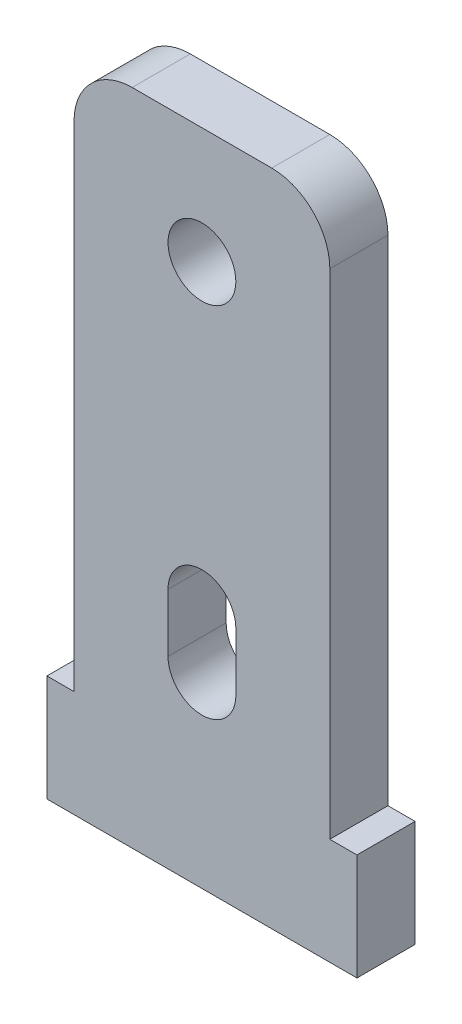
ISO-10303-21;
HEADER;
FILE_DESCRIPTION(('STEP AP214'),'2;1');
FILE_NAME('part.step','',(''),(''),'','','');
FILE_SCHEMA(('AUTOMOTIVE_DESIGN { 1 0 10303 214 1 1 1 1 }'));
ENDSEC;
DATA;
#1=APPLICATION_CONTEXT('core data for automotive mechanical design processes');
#2=APPLICATION_PROTOCOL_DEFINITION('international standard','automotive_design',2000,#1);
#3=PRODUCT_CONTEXT('',#1,'mechanical');
#4=PRODUCT('Part','Part','',(#3));
#5=PRODUCT_RELATED_PRODUCT_CATEGORY('part','',(#4));
#6=PRODUCT_DEFINITION_FORMATION('','',#4);
#7=PRODUCT_DEFINITION_CONTEXT('part definition',#1,'design');
#8=PRODUCT_DEFINITION('design','',#6,#7);
#9=PRODUCT_DEFINITION_SHAPE('','',#8);
#10=(LENGTH_UNIT() NAMED_UNIT(*) SI_UNIT(.MILLI.,.METRE.));
#11=(NAMED_UNIT(*) PLANE_ANGLE_UNIT() SI_UNIT($,.RADIAN.));
#12=(NAMED_UNIT(*) SI_UNIT($,.STERADIAN.) SOLID_ANGLE_UNIT());
#13=UNCERTAINTY_MEASURE_WITH_UNIT(LENGTH_MEASURE(1.E-05),#10,'distance_accuracy_value','');
#14=(GEOMETRIC_REPRESENTATION_CONTEXT(3) GLOBAL_UNCERTAINTY_ASSIGNED_CONTEXT((#13)) GLOBAL_UNIT_ASSIGNED_CONTEXT((#10,
#11,#12)) REPRESENTATION_CONTEXT('',''));
#15=CARTESIAN_POINT('',(0.,0.,0.));
#16=DIRECTION('',(0.,0.,1.));
#17=DIRECTION('',(1.,0.,0.));
#18=AXIS2_PLACEMENT_3D('',#15,#16,#17);
#19=CARTESIAN_POINT('',(0.,18.5,3.));
#20=DIRECTION('',(0.,1.,0.));
#21=DIRECTION('',(0.,0.,1.));
#22=AXIS2_PLACEMENT_3D('',#19,#20,#21);
#23=PLANE('',#22);
#24=DIRECTION('',(1.,0.,0.));
#25=VECTOR('',#24,1.);
#26=CARTESIAN_POINT('',(0.,18.5,0.));
#27=LINE('',#26,#25);
#28=CARTESIAN_POINT('',(-3.6,18.5,0.));
#29=VERTEX_POINT('',#28);
#30=CARTESIAN_POINT('',(3.6,18.5,0.));
#31=VERTEX_POINT('',#30);
#32=EDGE_CURVE('E185',#29,#31,#27,.T.);
#33=ORIENTED_EDGE('',*,*,#32,.F.);
#34=DIRECTION('',(0.,0.,-1.));
#35=VECTOR('',#34,1.);
#36=CARTESIAN_POINT('',(-3.6,18.5,3.));
#37=LINE('',#36,#35);
#38=CARTESIAN_POINT('',(-3.6,18.5,3.));
#39=VERTEX_POINT('',#38);
#40=EDGE_CURVE('E11',#39,#29,#37,.T.);
#41=ORIENTED_EDGE('',*,*,#40,.F.);
#42=DIRECTION('',(1.,0.,0.));
#43=VECTOR('',#42,1.);
#44=CARTESIAN_POINT('',(0.,18.5,3.));
#45=LINE('',#44,#43);
#46=CARTESIAN_POINT('',(3.6,18.5,3.));
#47=VERTEX_POINT('',#46);
#48=EDGE_CURVE('E252',#39,#47,#45,.T.);
#49=ORIENTED_EDGE('',*,*,#48,.T.);
#50=DIRECTION('',(0.,0.,-1.));
#51=VECTOR('',#50,1.);
#52=CARTESIAN_POINT('',(3.6,18.5,3.));
#53=LINE('',#52,#51);
#54=EDGE_CURVE('E53',#47,#31,#53,.T.);
#55=ORIENTED_EDGE('',*,*,#54,.T.);
#56=EDGE_LOOP('',(#33,#41,#49,#55));
#57=FACE_BOUND('',#56,.T.);
#58=ADVANCED_FACE('F34',(#57),#23,.T.);
#59=CARTESIAN_POINT('',(-3.6,15.5,3.));
#60=DIRECTION('',(0.,0.,-1.));
#61=DIRECTION('',(-1.,0.,0.));
#62=AXIS2_PLACEMENT_3D('',#59,#60,#61);
#63=CYLINDRICAL_SURFACE('',#62,3.);
#64=CARTESIAN_POINT('',(-3.6,15.5,0.));
#65=DIRECTION('',(0.,0.,1.));
#66=DIRECTION('',(1.,0.,0.));
#67=AXIS2_PLACEMENT_3D('',#64,#65,#66);
#68=CIRCLE('',#67,3.);
#69=CARTESIAN_POINT('',(-6.6,15.5,0.));
#70=VERTEX_POINT('',#69);
#71=EDGE_CURVE('E187',#29,#70,#68,.T.);
#72=ORIENTED_EDGE('',*,*,#71,.T.);
#73=DIRECTION('',(0.,0.,-1.));
#74=VECTOR('',#73,1.);
#75=CARTESIAN_POINT('',(-6.6,15.5,3.));
#76=LINE('',#75,#74);
#77=CARTESIAN_POINT('',(-6.6,15.5,3.));
#78=VERTEX_POINT('',#77);
#79=EDGE_CURVE('E44',#78,#70,#76,.T.);
#80=ORIENTED_EDGE('',*,*,#79,.F.);
#81=CARTESIAN_POINT('',(-3.6,15.5,3.));
#82=DIRECTION('',(0.,0.,1.));
#83=DIRECTION('',(1.,0.,0.));
#84=AXIS2_PLACEMENT_3D('',#81,#82,#83);
#85=CIRCLE('',#84,3.);
#86=EDGE_CURVE('E260',#39,#78,#85,.T.);
#87=ORIENTED_EDGE('',*,*,#86,.F.);
#88=ORIENTED_EDGE('',*,*,#40,.T.);
#89=EDGE_LOOP('',(#72,#80,#87,#88));
#90=FACE_BOUND('',#89,.T.);
#91=ADVANCED_FACE('F290',(#90),#63,.T.);
#92=CARTESIAN_POINT('',(-6.6,0.,3.));
#93=DIRECTION('',(1.,0.,0.));
#94=DIRECTION('',(0.,1.,0.));
#95=AXIS2_PLACEMENT_3D('',#92,#93,#94);
#96=PLANE('',#95);
#97=DIRECTION('',(0.,-1.,0.));
#98=VECTOR('',#97,1.);
#99=CARTESIAN_POINT('',(-6.6,0.,0.));
#100=LINE('',#99,#98);
#101=CARTESIAN_POINT('',(-6.59999999999999,-10.,0.));
#102=VERTEX_POINT('',#101);
#103=EDGE_CURVE('E190',#70,#102,#100,.T.);
#104=ORIENTED_EDGE('',*,*,#103,.T.);
#105=DIRECTION('',(0.,0.,-1.));
#106=VECTOR('',#105,1.);
#107=CARTESIAN_POINT('',(-6.59999999999999,-10.,3.));
#108=LINE('',#107,#106);
#109=CARTESIAN_POINT('',(-6.59999999999999,-10.,3.));
#110=VERTEX_POINT('',#109);
#111=EDGE_CURVE('E222',#110,#102,#108,.T.);
#112=ORIENTED_EDGE('',*,*,#111,.F.);
#113=DIRECTION('',(0.,-1.,0.));
#114=VECTOR('',#113,1.);
#115=CARTESIAN_POINT('',(-6.6,0.,3.));
#116=LINE('',#115,#114);
#117=EDGE_CURVE('E263',#78,#110,#116,.T.);
#118=ORIENTED_EDGE('',*,*,#117,.F.);
#119=ORIENTED_EDGE('',*,*,#79,.T.);
#120=EDGE_LOOP('',(#104,#112,#118,#119));
#121=FACE_BOUND('',#120,.T.);
#122=ADVANCED_FACE('F295',(#121),#96,.F.);
#123=CARTESIAN_POINT('',(0.,-10.,3.));
#124=DIRECTION('',(0.,1.,0.));
#125=DIRECTION('',(-1.,0.,0.));
#126=AXIS2_PLACEMENT_3D('',#123,#124,#125);
#127=PLANE('',#126);
#128=DIRECTION('',(1.,0.,0.));
#129=VECTOR('',#128,1.);
#130=CARTESIAN_POINT('',(0.,-10.,0.));
#131=LINE('',#130,#129);
#132=CARTESIAN_POINT('',(-8.,-10.,0.));
#133=VERTEX_POINT('',#132);
#134=EDGE_CURVE('E193',#133,#102,#131,.T.);
#135=ORIENTED_EDGE('',*,*,#134,.F.);
#136=DIRECTION('',(0.,0.,-1.));
#137=VECTOR('',#136,1.);
#138=CARTESIAN_POINT('',(-8.,-10.,3.));
#139=LINE('',#138,#137);
#140=CARTESIAN_POINT('',(-8.,-10.,3.));
#141=VERTEX_POINT('',#140);
#142=EDGE_CURVE('E220',#141,#133,#139,.T.);
#143=ORIENTED_EDGE('',*,*,#142,.F.);
#144=DIRECTION('',(1.,0.,0.));
#145=VECTOR('',#144,1.);
#146=CARTESIAN_POINT('',(0.,-10.,3.));
#147=LINE('',#146,#145);
#148=EDGE_CURVE('E265',#141,#110,#147,.T.);
#149=ORIENTED_EDGE('',*,*,#148,.T.);
#150=ORIENTED_EDGE('',*,*,#111,.T.);
#151=EDGE_LOOP('',(#135,#143,#149,#150));
#152=FACE_BOUND('',#151,.T.);
#153=ADVANCED_FACE('F323',(#152),#127,.T.);
#154=CARTESIAN_POINT('',(-8.,0.,3.));
#155=DIRECTION('',(1.,0.,0.));
#156=DIRECTION('',(0.,0.,-1.));
#157=AXIS2_PLACEMENT_3D('',#154,#155,#156);
#158=PLANE('',#157);
#159=DIRECTION('',(0.,-1.,0.));
#160=VECTOR('',#159,1.);
#161=CARTESIAN_POINT('',(-8.,0.,0.));
#162=LINE('',#161,#160);
#163=CARTESIAN_POINT('',(-8.,-15.5,0.));
#164=VERTEX_POINT('',#163);
#165=EDGE_CURVE('E196',#133,#164,#162,.T.);
#166=ORIENTED_EDGE('',*,*,#165,.T.);
#167=DIRECTION('',(0.,0.,-1.));
#168=VECTOR('',#167,1.);
#169=CARTESIAN_POINT('',(-8.,-15.5,3.));
#170=LINE('',#169,#168);
#171=CARTESIAN_POINT('',(-8.,-15.5,3.));
#172=VERTEX_POINT('',#171);
#173=EDGE_CURVE('E217',#172,#164,#170,.T.);
#174=ORIENTED_EDGE('',*,*,#173,.F.);
#175=DIRECTION('',(0.,-1.,0.));
#176=VECTOR('',#175,1.);
#177=CARTESIAN_POINT('',(-8.,0.,3.));
#178=LINE('',#177,#176);
#179=EDGE_CURVE('E268',#141,#172,#178,.T.);
#180=ORIENTED_EDGE('',*,*,#179,.F.);
#181=ORIENTED_EDGE('',*,*,#142,.T.);
#182=EDGE_LOOP('',(#166,#174,#180,#181));
#183=FACE_BOUND('',#182,.T.);
#184=ADVANCED_FACE('F319',(#183),#158,.F.);
#185=CARTESIAN_POINT('',(0.,-15.5,3.));
#186=DIRECTION('',(0.,1.,0.));
#187=DIRECTION('',(-1.,0.,0.));
#188=AXIS2_PLACEMENT_3D('',#185,#186,#187);
#189=PLANE('',#188);
#190=DIRECTION('',(1.,0.,0.));
#191=VECTOR('',#190,1.);
#192=CARTESIAN_POINT('',(0.,-15.5,0.));
#193=LINE('',#192,#191);
#194=CARTESIAN_POINT('',(8.,-15.5,0.));
#195=VERTEX_POINT('',#194);
#196=EDGE_CURVE('E199',#164,#195,#193,.T.);
#197=ORIENTED_EDGE('',*,*,#196,.T.);
#198=DIRECTION('',(0.,0.,-1.));
#199=VECTOR('',#198,1.);
#200=CARTESIAN_POINT('',(8.,-15.5,3.));
#201=LINE('',#200,#199);
#202=CARTESIAN_POINT('',(8.,-15.5,3.));
#203=VERTEX_POINT('',#202);
#204=EDGE_CURVE('E215',#203,#195,#201,.T.);
#205=ORIENTED_EDGE('',*,*,#204,.F.);
#206=DIRECTION('',(1.,0.,0.));
#207=VECTOR('',#206,1.);
#208=CARTESIAN_POINT('',(0.,-15.5,3.));
#209=LINE('',#208,#207);
#210=EDGE_CURVE('E271',#172,#203,#209,.T.);
#211=ORIENTED_EDGE('',*,*,#210,.F.);
#212=ORIENTED_EDGE('',*,*,#173,.T.);
#213=EDGE_LOOP('',(#197,#205,#211,#212));
#214=FACE_BOUND('',#213,.T.);
#215=ADVANCED_FACE('F316',(#214),#189,.F.);
#216=CARTESIAN_POINT('',(7.99999999999999,0.,3.));
#217=DIRECTION('',(1.,0.,0.));
#218=DIRECTION('',(0.,1.,0.));
#219=AXIS2_PLACEMENT_3D('',#216,#217,#218);
#220=PLANE('',#219);
#221=DIRECTION('',(0.,-1.,0.));
#222=VECTOR('',#221,1.);
#223=CARTESIAN_POINT('',(7.99999999999999,0.,0.));
#224=LINE('',#223,#222);
#225=CARTESIAN_POINT('',(8.,-10.,0.));
#226=VERTEX_POINT('',#225);
#227=EDGE_CURVE('E202',#226,#195,#224,.T.);
#228=ORIENTED_EDGE('',*,*,#227,.F.);
#229=DIRECTION('',(0.,0.,-1.));
#230=VECTOR('',#229,1.);
#231=CARTESIAN_POINT('',(8.,-10.,3.));
#232=LINE('',#231,#230);
#233=CARTESIAN_POINT('',(8.,-10.,3.));
#234=VERTEX_POINT('',#233);
#235=EDGE_CURVE('E151',#234,#226,#232,.T.);
#236=ORIENTED_EDGE('',*,*,#235,.F.);
#237=DIRECTION('',(0.,-1.,0.));
#238=VECTOR('',#237,1.);
#239=CARTESIAN_POINT('',(7.99999999999999,0.,3.));
#240=LINE('',#239,#238);
#241=EDGE_CURVE('E161',#234,#203,#240,.T.);
#242=ORIENTED_EDGE('',*,*,#241,.T.);
#243=ORIENTED_EDGE('',*,*,#204,.T.);
#244=EDGE_LOOP('',(#228,#236,#242,#243));
#245=FACE_BOUND('',#244,.T.);
#246=ADVANCED_FACE('F274',(#245),#220,.T.);
#247=CARTESIAN_POINT('',(0.,-10.,3.));
#248=DIRECTION('',(0.,1.,0.));
#249=DIRECTION('',(-1.,0.,0.));
#250=AXIS2_PLACEMENT_3D('',#247,#248,#249);
#251=PLANE('',#250);
#252=DIRECTION('',(1.,0.,0.));
#253=VECTOR('',#252,1.);
#254=CARTESIAN_POINT('',(0.,-10.,0.));
#255=LINE('',#254,#253);
#256=CARTESIAN_POINT('',(6.6,-10.,0.));
#257=VERTEX_POINT('',#256);
#258=EDGE_CURVE('E147',#257,#226,#255,.T.);
#259=ORIENTED_EDGE('',*,*,#258,.F.);
#260=DIRECTION('',(0.,0.,-1.));
#261=VECTOR('',#260,1.);
#262=CARTESIAN_POINT('',(6.6,-10.,3.));
#263=LINE('',#262,#261);
#264=CARTESIAN_POINT('',(6.6,-10.,3.));
#265=VERTEX_POINT('',#264);
#266=EDGE_CURVE('E142',#265,#257,#263,.T.);
#267=ORIENTED_EDGE('',*,*,#266,.F.);
#268=DIRECTION('',(1.,0.,0.));
#269=VECTOR('',#268,1.);
#270=CARTESIAN_POINT('',(0.,-10.,3.));
#271=LINE('',#270,#269);
#272=EDGE_CURVE('E145',#265,#234,#271,.T.);
#273=ORIENTED_EDGE('',*,*,#272,.T.);
#274=ORIENTED_EDGE('',*,*,#235,.T.);
#275=EDGE_LOOP('',(#259,#267,#273,#274));
#276=FACE_BOUND('',#275,.T.);
#277=ADVANCED_FACE('F144',(#276),#251,.T.);
#278=CARTESIAN_POINT('',(6.6,0.,3.));
#279=DIRECTION('',(1.,0.,0.));
#280=DIRECTION('',(0.,0.,-1.));
#281=AXIS2_PLACEMENT_3D('',#278,#279,#280);
#282=PLANE('',#281);
#283=DIRECTION('',(0.,-1.,0.));
#284=VECTOR('',#283,1.);
#285=CARTESIAN_POINT('',(6.6,0.,0.));
#286=LINE('',#285,#284);
#287=CARTESIAN_POINT('',(6.6,15.5,0.));
#288=VERTEX_POINT('',#287);
#289=EDGE_CURVE('E206',#288,#257,#286,.T.);
#290=ORIENTED_EDGE('',*,*,#289,.F.);
#291=DIRECTION('',(0.,0.,-1.));
#292=VECTOR('',#291,1.);
#293=CARTESIAN_POINT('',(6.6,15.5,3.));
#294=LINE('',#293,#292);
#295=CARTESIAN_POINT('',(6.6,15.5,3.));
#296=VERTEX_POINT('',#295);
#297=EDGE_CURVE('E96',#296,#288,#294,.T.);
#298=ORIENTED_EDGE('',*,*,#297,.F.);
#299=DIRECTION('',(0.,-1.,0.));
#300=VECTOR('',#299,1.);
#301=CARTESIAN_POINT('',(6.6,0.,3.));
#302=LINE('',#301,#300);
#303=EDGE_CURVE('E159',#296,#265,#302,.T.);
#304=ORIENTED_EDGE('',*,*,#303,.T.);
#305=ORIENTED_EDGE('',*,*,#266,.T.);
#306=EDGE_LOOP('',(#290,#298,#304,#305));
#307=FACE_BOUND('',#306,.T.);
#308=ADVANCED_FACE('F163',(#307),#282,.T.);
#309=CARTESIAN_POINT('',(0.,-6.,3.));
#310=DIRECTION('',(0.,0.,-1.));
#311=DIRECTION('',(-1.,0.,0.));
#312=AXIS2_PLACEMENT_3D('',#309,#310,#311);
#313=CYLINDRICAL_SURFACE('',#312,1.75);
#314=CARTESIAN_POINT('',(0.,-6.,0.));
#315=DIRECTION('',(0.,0.,1.));
#316=DIRECTION('',(1.,0.,0.));
#317=AXIS2_PLACEMENT_3D('',#314,#315,#316);
#318=CIRCLE('',#317,1.75);
#319=CARTESIAN_POINT('',(-1.75,-6.,0.));
#320=VERTEX_POINT('',#319);
#321=CARTESIAN_POINT('',(1.75,-6.,0.));
#322=VERTEX_POINT('',#321);
#323=EDGE_CURVE('E173',#320,#322,#318,.T.);
#324=ORIENTED_EDGE('',*,*,#323,.F.);
#325=DIRECTION('',(0.,0.,-1.));
#326=VECTOR('',#325,1.);
#327=CARTESIAN_POINT('',(-1.75,-6.,3.));
#328=LINE('',#327,#326);
#329=CARTESIAN_POINT('',(-1.75,-6.,3.));
#330=VERTEX_POINT('',#329);
#331=EDGE_CURVE('E38',#330,#320,#328,.T.);
#332=ORIENTED_EDGE('',*,*,#331,.F.);
#333=CARTESIAN_POINT('',(0.,-6.,3.));
#334=DIRECTION('',(0.,0.,1.));
#335=DIRECTION('',(1.,0.,0.));
#336=AXIS2_PLACEMENT_3D('',#333,#334,#335);
#337=CIRCLE('',#336,1.75);
#338=CARTESIAN_POINT('',(1.75,-6.,3.));
#339=VERTEX_POINT('',#338);
#340=EDGE_CURVE('E255',#330,#339,#337,.T.);
#341=ORIENTED_EDGE('',*,*,#340,.T.);
#342=DIRECTION('',(0.,0.,-1.));
#343=VECTOR('',#342,1.);
#344=CARTESIAN_POINT('',(1.75,-6.,3.));
#345=LINE('',#344,#343);
#346=EDGE_CURVE('E166',#339,#322,#345,.T.);
#347=ORIENTED_EDGE('',*,*,#346,.T.);
#348=EDGE_LOOP('',(#324,#332,#341,#347));
#349=FACE_BOUND('',#348,.T.);
#350=ADVANCED_FACE('F238',(#349),#313,.F.);
#351=CARTESIAN_POINT('',(-1.75,0.,3.));
#352=DIRECTION('',(1.,0.,0.));
#353=DIRECTION('',(0.,1.,0.));
#354=AXIS2_PLACEMENT_3D('',#351,#352,#353);
#355=PLANE('',#354);
#356=DIRECTION('',(0.,-1.,0.));
#357=VECTOR('',#356,1.);
#358=CARTESIAN_POINT('',(-1.75,0.,0.));
#359=LINE('',#358,#357);
#360=CARTESIAN_POINT('',(-1.75,-3.,0.));
#361=VERTEX_POINT('',#360);
#362=EDGE_CURVE('E176',#361,#320,#359,.T.);
#363=ORIENTED_EDGE('',*,*,#362,.F.);
#364=DIRECTION('',(0.,0.,-1.));
#365=VECTOR('',#364,1.);
#366=CARTESIAN_POINT('',(-1.75,-3.,3.));
#367=LINE('',#366,#365);
#368=CARTESIAN_POINT('',(-1.75,-3.,3.));
#369=VERTEX_POINT('',#368);
#370=EDGE_CURVE('E228',#369,#361,#367,.T.);
#371=ORIENTED_EDGE('',*,*,#370,.F.);
#372=DIRECTION('',(0.,-1.,0.));
#373=VECTOR('',#372,1.);
#374=CARTESIAN_POINT('',(-1.75,0.,3.));
#375=LINE('',#374,#373);
#376=EDGE_CURVE('E237',#369,#330,#375,.T.);
#377=ORIENTED_EDGE('',*,*,#376,.T.);
#378=ORIENTED_EDGE('',*,*,#331,.T.);
#379=EDGE_LOOP('',(#363,#371,#377,#378));
#380=FACE_BOUND('',#379,.T.);
#381=ADVANCED_FACE('F235',(#380),#355,.T.);
#382=CARTESIAN_POINT('',(0.,-3.,3.));
#383=DIRECTION('',(0.,0.,-1.));
#384=DIRECTION('',(-1.,0.,0.));
#385=AXIS2_PLACEMENT_3D('',#382,#383,#384);
#386=CYLINDRICAL_SURFACE('',#385,1.75);
#387=CARTESIAN_POINT('',(0.,-3.,0.));
#388=DIRECTION('',(0.,0.,1.));
#389=DIRECTION('',(1.,0.,0.));
#390=AXIS2_PLACEMENT_3D('',#387,#388,#389);
#391=CIRCLE('',#390,1.75);
#392=CARTESIAN_POINT('',(1.75,-3.,0.));
#393=VERTEX_POINT('',#392);
#394=EDGE_CURVE('E179',#393,#361,#391,.T.);
#395=ORIENTED_EDGE('',*,*,#394,.F.);
#396=DIRECTION('',(0.,0.,-1.));
#397=VECTOR('',#396,1.);
#398=CARTESIAN_POINT('',(1.75,-3.,3.));
#399=LINE('',#398,#397);
#400=CARTESIAN_POINT('',(1.75,-3.,3.));
#401=VERTEX_POINT('',#400);
#402=EDGE_CURVE('E227',#401,#393,#399,.T.);
#403=ORIENTED_EDGE('',*,*,#402,.F.);
#404=CARTESIAN_POINT('',(0.,-3.,3.));
#405=DIRECTION('',(0.,0.,1.));
#406=DIRECTION('',(1.,0.,0.));
#407=AXIS2_PLACEMENT_3D('',#404,#405,#406);
#408=CIRCLE('',#407,1.75);
#409=EDGE_CURVE('E247',#401,#369,#408,.T.);
#410=ORIENTED_EDGE('',*,*,#409,.T.);
#411=ORIENTED_EDGE('',*,*,#370,.T.);
#412=EDGE_LOOP('',(#395,#403,#410,#411));
#413=FACE_BOUND('',#412,.T.);
#414=ADVANCED_FACE('F244',(#413),#386,.F.);
#415=CARTESIAN_POINT('',(1.75,0.,3.));
#416=DIRECTION('',(1.,0.,0.));
#417=DIRECTION('',(0.,0.,-1.));
#418=AXIS2_PLACEMENT_3D('',#415,#416,#417);
#419=PLANE('',#418);
#420=DIRECTION('',(0.,-1.,0.));
#421=VECTOR('',#420,1.);
#422=CARTESIAN_POINT('',(1.75,0.,0.));
#423=LINE('',#422,#421);
#424=EDGE_CURVE('E182',#393,#322,#423,.T.);
#425=ORIENTED_EDGE('',*,*,#424,.T.);
#426=ORIENTED_EDGE('',*,*,#346,.F.);
#427=DIRECTION('',(0.,-1.,0.));
#428=VECTOR('',#427,1.);
#429=CARTESIAN_POINT('',(1.75,0.,3.));
#430=LINE('',#429,#428);
#431=EDGE_CURVE('E249',#401,#339,#430,.T.);
#432=ORIENTED_EDGE('',*,*,#431,.F.);
#433=ORIENTED_EDGE('',*,*,#402,.T.);
#434=EDGE_LOOP('',(#425,#426,#432,#433));
#435=FACE_BOUND('',#434,.T.);
#436=ADVANCED_FACE('F250',(#435),#419,.F.);
#437=CARTESIAN_POINT('',(0.,12.5,3.));
#438=DIRECTION('',(0.,0.,-1.));
#439=DIRECTION('',(-1.,0.,0.));
#440=AXIS2_PLACEMENT_3D('',#437,#438,#439);
#441=CYLINDRICAL_SURFACE('',#440,1.75);
#442=CARTESIAN_POINT('',(0.,12.5,3.));
#443=DIRECTION('',(0.,0.,1.));
#444=DIRECTION('',(1.,0.,0.));
#445=AXIS2_PLACEMENT_3D('',#442,#443,#444);
#446=CIRCLE('',#445,1.75);
#447=CARTESIAN_POINT('',(1.75,12.5,3.));
#448=VERTEX_POINT('',#447);
#449=EDGE_CURVE('E211',#448,#448,#446,.T.);
#450=ORIENTED_EDGE('',*,*,#449,.T.);
#451=EDGE_LOOP('',(#450));
#452=FACE_BOUND('',#451,.T.);
#453=CARTESIAN_POINT('',(0.,12.5,0.));
#454=DIRECTION('',(0.,0.,1.));
#455=DIRECTION('',(1.,0.,0.));
#456=AXIS2_PLACEMENT_3D('',#453,#454,#455);
#457=CIRCLE('',#456,1.75);
#458=CARTESIAN_POINT('',(1.75,12.5,0.));
#459=VERTEX_POINT('',#458);
#460=EDGE_CURVE('E170',#459,#459,#457,.T.);
#461=ORIENTED_EDGE('',*,*,#460,.F.);
#462=EDGE_LOOP('',(#461));
#463=FACE_BOUND('',#462,.T.);
#464=ADVANCED_FACE('F36',(#452,#463),#441,.F.);
#465=CARTESIAN_POINT('',(3.6,15.5,3.));
#466=DIRECTION('',(0.,0.,-1.));
#467=DIRECTION('',(-1.,0.,0.));
#468=AXIS2_PLACEMENT_3D('',#465,#466,#467);
#469=CYLINDRICAL_SURFACE('',#468,3.);
#470=CARTESIAN_POINT('',(3.6,15.5,0.));
#471=DIRECTION('',(0.,0.,1.));
#472=DIRECTION('',(1.,0.,0.));
#473=AXIS2_PLACEMENT_3D('',#470,#471,#472);
#474=CIRCLE('',#473,3.);
#475=EDGE_CURVE('E208',#31,#288,#474,.F.);
#476=ORIENTED_EDGE('',*,*,#475,.F.);
#477=ORIENTED_EDGE('',*,*,#54,.F.);
#478=CARTESIAN_POINT('',(3.6,15.5,3.));
#479=DIRECTION('',(0.,0.,1.));
#480=DIRECTION('',(1.,0.,0.));
#481=AXIS2_PLACEMENT_3D('',#478,#479,#480);
#482=CIRCLE('',#481,3.);
#483=EDGE_CURVE('E164',#47,#296,#482,.F.);
#484=ORIENTED_EDGE('',*,*,#483,.T.);
#485=ORIENTED_EDGE('',*,*,#297,.T.);
#486=EDGE_LOOP('',(#476,#477,#484,#485));
#487=FACE_BOUND('',#486,.T.);
#488=ADVANCED_FACE('F277',(#487),#469,.T.);
#489=CARTESIAN_POINT('',(0.,0.,3.));
#490=DIRECTION('',(0.,0.,1.));
#491=DIRECTION('',(1.,0.,0.));
#492=AXIS2_PLACEMENT_3D('',#489,#490,#491);
#493=PLANE('',#492);
#494=ORIENTED_EDGE('',*,*,#449,.F.);
#495=EDGE_LOOP('',(#494));
#496=FACE_BOUND('',#495,.T.);
#497=ORIENTED_EDGE('',*,*,#340,.F.);
#498=ORIENTED_EDGE('',*,*,#376,.F.);
#499=ORIENTED_EDGE('',*,*,#409,.F.);
#500=ORIENTED_EDGE('',*,*,#431,.T.);
#501=EDGE_LOOP('',(#497,#498,#499,#500));
#502=FACE_BOUND('',#501,.T.);
#503=ORIENTED_EDGE('',*,*,#48,.F.);
#504=ORIENTED_EDGE('',*,*,#86,.T.);
#505=ORIENTED_EDGE('',*,*,#117,.T.);
#506=ORIENTED_EDGE('',*,*,#148,.F.);
#507=ORIENTED_EDGE('',*,*,#179,.T.);
#508=ORIENTED_EDGE('',*,*,#210,.T.);
#509=ORIENTED_EDGE('',*,*,#241,.F.);
#510=ORIENTED_EDGE('',*,*,#272,.F.);
#511=ORIENTED_EDGE('',*,*,#303,.F.);
#512=ORIENTED_EDGE('',*,*,#483,.F.);
#513=EDGE_LOOP('',(#503,#504,#505,#506,#507,#508,#509,#510,#511,#512));
#514=FACE_BOUND('',#513,.T.);
#515=ADVANCED_FACE('F157',(#496,#502,#514),#493,.T.);
#516=CARTESIAN_POINT('',(0.,0.,0.));
#517=DIRECTION('',(0.,0.,1.));
#518=DIRECTION('',(1.,0.,0.));
#519=AXIS2_PLACEMENT_3D('',#516,#517,#518);
#520=PLANE('',#519);
#521=ORIENTED_EDGE('',*,*,#460,.T.);
#522=EDGE_LOOP('',(#521));
#523=FACE_BOUND('',#522,.T.);
#524=ORIENTED_EDGE('',*,*,#323,.T.);
#525=ORIENTED_EDGE('',*,*,#424,.F.);
#526=ORIENTED_EDGE('',*,*,#394,.T.);
#527=ORIENTED_EDGE('',*,*,#362,.T.);
#528=EDGE_LOOP('',(#524,#525,#526,#527));
#529=FACE_BOUND('',#528,.T.);
#530=ORIENTED_EDGE('',*,*,#32,.T.);
#531=ORIENTED_EDGE('',*,*,#475,.T.);
#532=ORIENTED_EDGE('',*,*,#289,.T.);
#533=ORIENTED_EDGE('',*,*,#258,.T.);
#534=ORIENTED_EDGE('',*,*,#227,.T.);
#535=ORIENTED_EDGE('',*,*,#196,.F.);
#536=ORIENTED_EDGE('',*,*,#165,.F.);
#537=ORIENTED_EDGE('',*,*,#134,.T.);
#538=ORIENTED_EDGE('',*,*,#103,.F.);
#539=ORIENTED_EDGE('',*,*,#71,.F.);
#540=EDGE_LOOP('',(#530,#531,#532,#533,#534,#535,#536,#537,#538,#539));
#541=FACE_BOUND('',#540,.T.);
#542=ADVANCED_FACE('F242',(#523,#529,#541),#520,.F.);
#543=CLOSED_SHELL('',(#58,#91,#122,#153,#184,#215,#246,#277,#308,#350,#381,#414,#436,#464,#488,
#515,#542));
#544=MANIFOLD_SOLID_BREP('B2',#543);
#545=ADVANCED_BREP_SHAPE_REPRESENTATION('',(#18,#544),#14);
#546=SHAPE_DEFINITION_REPRESENTATION(#9,#545);
ENDSEC;
END-ISO-10303-21;
